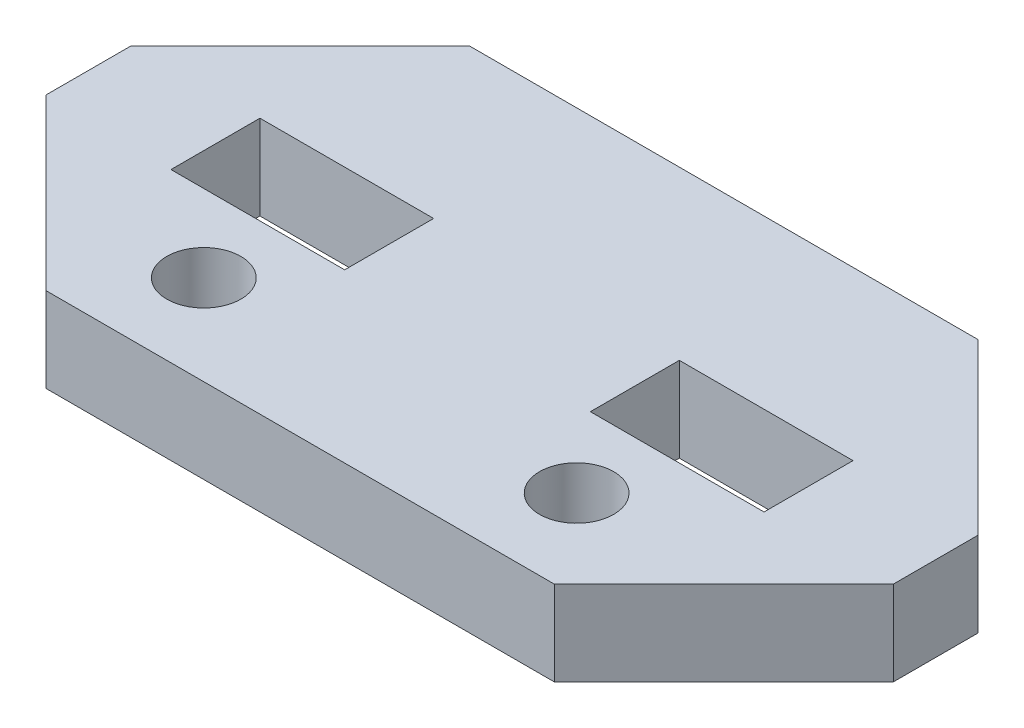
ISO-10303-21;
HEADER;
FILE_DESCRIPTION(('STEP AP214'),'2;1');
FILE_NAME('part.step','',(''),(''),'','','');
FILE_SCHEMA(('AUTOMOTIVE_DESIGN { 1 0 10303 214 1 1 1 1 }'));
ENDSEC;
DATA;
#1=APPLICATION_CONTEXT('core data for automotive mechanical design processes');
#2=APPLICATION_PROTOCOL_DEFINITION('international standard','automotive_design',2000,#1);
#3=PRODUCT_CONTEXT('',#1,'mechanical');
#4=PRODUCT('Part','Part','',(#3));
#5=PRODUCT_RELATED_PRODUCT_CATEGORY('part','',(#4));
#6=PRODUCT_DEFINITION_FORMATION('','',#4);
#7=PRODUCT_DEFINITION_CONTEXT('part definition',#1,'design');
#8=PRODUCT_DEFINITION('design','',#6,#7);
#9=PRODUCT_DEFINITION_SHAPE('','',#8);
#10=(LENGTH_UNIT() NAMED_UNIT(*) SI_UNIT(.MILLI.,.METRE.));
#11=(NAMED_UNIT(*) PLANE_ANGLE_UNIT() SI_UNIT($,.RADIAN.));
#12=(NAMED_UNIT(*) SI_UNIT($,.STERADIAN.) SOLID_ANGLE_UNIT());
#13=UNCERTAINTY_MEASURE_WITH_UNIT(LENGTH_MEASURE(1.E-05),#10,'distance_accuracy_value','');
#14=(GEOMETRIC_REPRESENTATION_CONTEXT(3) GLOBAL_UNCERTAINTY_ASSIGNED_CONTEXT((#13)) GLOBAL_UNIT_ASSIGNED_CONTEXT((#10,
#11,#12)) REPRESENTATION_CONTEXT('',''));
#15=CARTESIAN_POINT('',(0.,0.,0.));
#16=DIRECTION('',(0.,0.,1.));
#17=DIRECTION('',(1.,0.,0.));
#18=AXIS2_PLACEMENT_3D('',#15,#16,#17);
#19=CARTESIAN_POINT('',(0.,4.,0.));
#20=DIRECTION('',(0.,-1.,0.));
#21=DIRECTION('',(0.,0.,-1.));
#22=AXIS2_PLACEMENT_3D('',#19,#20,#21);
#23=PLANE('',#22);
#24=CARTESIAN_POINT('',(-8.8,4.,5.75));
#25=DIRECTION('',(0.,1.,0.));
#26=DIRECTION('',(0.,0.,1.));
#27=AXIS2_PLACEMENT_3D('',#24,#25,#26);
#28=CIRCLE('',#27,1.75);
#29=CARTESIAN_POINT('',(-8.8,4.,7.5));
#30=VERTEX_POINT('',#29);
#31=EDGE_CURVE('E374',#30,#30,#28,.T.);
#32=ORIENTED_EDGE('',*,*,#31,.F.);
#33=EDGE_LOOP('',(#32));
#34=FACE_BOUND('',#33,.T.);
#35=CARTESIAN_POINT('',(8.8,4.,5.75));
#36=DIRECTION('',(0.,1.,0.));
#37=DIRECTION('',(0.,0.,1.));
#38=AXIS2_PLACEMENT_3D('',#35,#36,#37);
#39=CIRCLE('',#38,1.75);
#40=CARTESIAN_POINT('',(8.8,4.,7.5));
#41=VERTEX_POINT('',#40);
#42=EDGE_CURVE('E378',#41,#41,#39,.T.);
#43=ORIENTED_EDGE('',*,*,#42,.F.);
#44=EDGE_LOOP('',(#43));
#45=FACE_BOUND('',#44,.T.);
#46=DIRECTION('',(-1.,0.,0.));
#47=VECTOR('',#46,1.);
#48=CARTESIAN_POINT('',(-5.8,4.,-2.1));
#49=LINE('',#48,#47);
#50=CARTESIAN_POINT('',(-5.8,4.,-2.1));
#51=VERTEX_POINT('',#50);
#52=CARTESIAN_POINT('',(-14.,4.,-2.1));
#53=VERTEX_POINT('',#52);
#54=EDGE_CURVE('E181',#51,#53,#49,.T.);
#55=ORIENTED_EDGE('',*,*,#54,.F.);
#56=DIRECTION('',(0.,0.,-1.));
#57=VECTOR('',#56,1.);
#58=CARTESIAN_POINT('',(-5.8,4.,2.1));
#59=LINE('',#58,#57);
#60=CARTESIAN_POINT('',(-5.8,4.,2.1));
#61=VERTEX_POINT('',#60);
#62=EDGE_CURVE('E175',#61,#51,#59,.T.);
#63=ORIENTED_EDGE('',*,*,#62,.F.);
#64=DIRECTION('',(-1.,0.,0.));
#65=VECTOR('',#64,1.);
#66=CARTESIAN_POINT('',(-5.8,4.,2.1));
#67=LINE('',#66,#65);
#68=CARTESIAN_POINT('',(-14.,4.,2.1));
#69=VERTEX_POINT('',#68);
#70=EDGE_CURVE('E186',#61,#69,#67,.T.);
#71=ORIENTED_EDGE('',*,*,#70,.T.);
#72=DIRECTION('',(0.,0.,-1.));
#73=VECTOR('',#72,1.);
#74=CARTESIAN_POINT('',(-14.,4.,2.1));
#75=LINE('',#74,#73);
#76=EDGE_CURVE('E60',#69,#53,#75,.T.);
#77=ORIENTED_EDGE('',*,*,#76,.T.);
#78=EDGE_LOOP('',(#55,#63,#71,#77));
#79=FACE_BOUND('',#78,.T.);
#80=DIRECTION('',(-0.707106781186548,0.,0.707106781186547));
#81=VECTOR('',#80,1.);
#82=CARTESIAN_POINT('',(20.,4.,2.));
#83=LINE('',#82,#81);
#84=CARTESIAN_POINT('',(20.,4.,2.));
#85=VERTEX_POINT('',#84);
#86=CARTESIAN_POINT('',(12.,4.,10.));
#87=VERTEX_POINT('',#86);
#88=EDGE_CURVE('E227',#85,#87,#83,.T.);
#89=ORIENTED_EDGE('',*,*,#88,.F.);
#90=DIRECTION('',(0.,0.,-1.));
#91=VECTOR('',#90,1.);
#92=CARTESIAN_POINT('',(20.,4.,2.));
#93=LINE('',#92,#91);
#94=CARTESIAN_POINT('',(20.,4.,-2.));
#95=VERTEX_POINT('',#94);
#96=EDGE_CURVE('E248',#85,#95,#93,.T.);
#97=ORIENTED_EDGE('',*,*,#96,.T.);
#98=DIRECTION('',(0.707106781186547,0.,0.707106781186548));
#99=VECTOR('',#98,1.);
#100=CARTESIAN_POINT('',(12.,4.,-10.));
#101=LINE('',#100,#99);
#102=CARTESIAN_POINT('',(12.,4.,-10.));
#103=VERTEX_POINT('',#102);
#104=EDGE_CURVE('E245',#103,#95,#101,.T.);
#105=ORIENTED_EDGE('',*,*,#104,.F.);
#106=DIRECTION('',(-1.,0.,0.));
#107=VECTOR('',#106,1.);
#108=CARTESIAN_POINT('',(12.,4.,-10.));
#109=LINE('',#108,#107);
#110=CARTESIAN_POINT('',(-12.,4.,-10.));
#111=VERTEX_POINT('',#110);
#112=EDGE_CURVE('E243',#103,#111,#109,.T.);
#113=ORIENTED_EDGE('',*,*,#112,.T.);
#114=DIRECTION('',(0.707106781186548,0.,-0.707106781186547));
#115=VECTOR('',#114,1.);
#116=CARTESIAN_POINT('',(-20.,4.,-2.));
#117=LINE('',#116,#115);
#118=CARTESIAN_POINT('',(-20.,4.,-2.));
#119=VERTEX_POINT('',#118);
#120=EDGE_CURVE('E240',#119,#111,#117,.T.);
#121=ORIENTED_EDGE('',*,*,#120,.F.);
#122=DIRECTION('',(0.,0.,-1.));
#123=VECTOR('',#122,1.);
#124=CARTESIAN_POINT('',(-20.,4.,2.));
#125=LINE('',#124,#123);
#126=CARTESIAN_POINT('',(-20.,4.,2.));
#127=VERTEX_POINT('',#126);
#128=EDGE_CURVE('E237',#127,#119,#125,.T.);
#129=ORIENTED_EDGE('',*,*,#128,.F.);
#130=DIRECTION('',(-0.707106781186547,0.,-0.707106781186548));
#131=VECTOR('',#130,1.);
#132=CARTESIAN_POINT('',(-12.,4.,10.));
#133=LINE('',#132,#131);
#134=CARTESIAN_POINT('',(-12.,4.,10.));
#135=VERTEX_POINT('',#134);
#136=EDGE_CURVE('E234',#135,#127,#133,.T.);
#137=ORIENTED_EDGE('',*,*,#136,.F.);
#138=DIRECTION('',(-1.,0.,0.));
#139=VECTOR('',#138,1.);
#140=CARTESIAN_POINT('',(12.,4.,10.));
#141=LINE('',#140,#139);
#142=EDGE_CURVE('E230',#87,#135,#141,.T.);
#143=ORIENTED_EDGE('',*,*,#142,.F.);
#144=EDGE_LOOP('',(#89,#97,#105,#113,#121,#129,#137,#143));
#145=FACE_BOUND('',#144,.T.);
#146=DIRECTION('',(1.,0.,0.));
#147=VECTOR('',#146,1.);
#148=CARTESIAN_POINT('',(5.80000000000001,4.,-2.1));
#149=LINE('',#148,#147);
#150=CARTESIAN_POINT('',(5.80000000000001,4.,-2.1));
#151=VERTEX_POINT('',#150);
#152=CARTESIAN_POINT('',(14.,4.,-2.1));
#153=VERTEX_POINT('',#152);
#154=EDGE_CURVE('E68',#151,#153,#149,.T.);
#155=ORIENTED_EDGE('',*,*,#154,.T.);
#156=DIRECTION('',(0.,0.,-1.));
#157=VECTOR('',#156,1.);
#158=CARTESIAN_POINT('',(14.,4.,2.1));
#159=LINE('',#158,#157);
#160=CARTESIAN_POINT('',(14.,4.,2.1));
#161=VERTEX_POINT('',#160);
#162=EDGE_CURVE('E210',#161,#153,#159,.T.);
#163=ORIENTED_EDGE('',*,*,#162,.F.);
#164=DIRECTION('',(1.,0.,0.));
#165=VECTOR('',#164,1.);
#166=CARTESIAN_POINT('',(5.80000000000001,4.,2.1));
#167=LINE('',#166,#165);
#168=CARTESIAN_POINT('',(5.80000000000001,4.,2.1));
#169=VERTEX_POINT('',#168);
#170=EDGE_CURVE('E222',#169,#161,#167,.T.);
#171=ORIENTED_EDGE('',*,*,#170,.F.);
#172=DIRECTION('',(0.,0.,-1.));
#173=VECTOR('',#172,1.);
#174=CARTESIAN_POINT('',(5.80000000000001,4.,2.1));
#175=LINE('',#174,#173);
#176=EDGE_CURVE('E201',#169,#151,#175,.T.);
#177=ORIENTED_EDGE('',*,*,#176,.T.);
#178=EDGE_LOOP('',(#155,#163,#171,#177));
#179=FACE_BOUND('',#178,.T.);
#180=ADVANCED_FACE('F43',(#34,#45,#79,#145,#179),#23,.F.);
#181=CARTESIAN_POINT('',(0.,0.,0.));
#182=DIRECTION('',(0.,-1.,0.));
#183=DIRECTION('',(0.,0.,-1.));
#184=AXIS2_PLACEMENT_3D('',#181,#182,#183);
#185=PLANE('',#184);
#186=CARTESIAN_POINT('',(-8.8,0.,5.75));
#187=DIRECTION('',(0.,-1.,0.));
#188=DIRECTION('',(0.,0.,-1.));
#189=AXIS2_PLACEMENT_3D('',#186,#187,#188);
#190=CIRCLE('',#189,1.75);
#191=CARTESIAN_POINT('',(-8.8,0.,4.));
#192=VERTEX_POINT('',#191);
#193=EDGE_CURVE('E214',#192,#192,#190,.F.);
#194=ORIENTED_EDGE('',*,*,#193,.T.);
#195=EDGE_LOOP('',(#194));
#196=FACE_BOUND('',#195,.T.);
#197=CARTESIAN_POINT('',(8.8,0.,5.75));
#198=DIRECTION('',(0.,-1.,0.));
#199=DIRECTION('',(0.,0.,-1.));
#200=AXIS2_PLACEMENT_3D('',#197,#198,#199);
#201=CIRCLE('',#200,1.75);
#202=CARTESIAN_POINT('',(8.8,0.,4.));
#203=VERTEX_POINT('',#202);
#204=EDGE_CURVE('E381',#203,#203,#201,.F.);
#205=ORIENTED_EDGE('',*,*,#204,.T.);
#206=EDGE_LOOP('',(#205));
#207=FACE_BOUND('',#206,.T.);
#208=DIRECTION('',(0.,0.,-1.));
#209=VECTOR('',#208,1.);
#210=CARTESIAN_POINT('',(-5.8,0.,2.1));
#211=LINE('',#210,#209);
#212=CARTESIAN_POINT('',(-5.8,0.,2.1));
#213=VERTEX_POINT('',#212);
#214=CARTESIAN_POINT('',(-5.8,0.,-2.1));
#215=VERTEX_POINT('',#214);
#216=EDGE_CURVE('E172',#213,#215,#211,.T.);
#217=ORIENTED_EDGE('',*,*,#216,.T.);
#218=DIRECTION('',(-1.,0.,0.));
#219=VECTOR('',#218,1.);
#220=CARTESIAN_POINT('',(-5.8,0.,-2.1));
#221=LINE('',#220,#219);
#222=CARTESIAN_POINT('',(-14.,0.,-2.1));
#223=VERTEX_POINT('',#222);
#224=EDGE_CURVE('E158',#215,#223,#221,.T.);
#225=ORIENTED_EDGE('',*,*,#224,.T.);
#226=DIRECTION('',(0.,0.,-1.));
#227=VECTOR('',#226,1.);
#228=CARTESIAN_POINT('',(-14.,0.,2.1));
#229=LINE('',#228,#227);
#230=CARTESIAN_POINT('',(-14.,0.,2.1));
#231=VERTEX_POINT('',#230);
#232=EDGE_CURVE('E189',#231,#223,#229,.T.);
#233=ORIENTED_EDGE('',*,*,#232,.F.);
#234=DIRECTION('',(-1.,0.,0.));
#235=VECTOR('',#234,1.);
#236=CARTESIAN_POINT('',(-5.8,0.,2.1));
#237=LINE('',#236,#235);
#238=EDGE_CURVE('E180',#213,#231,#237,.T.);
#239=ORIENTED_EDGE('',*,*,#238,.F.);
#240=EDGE_LOOP('',(#217,#225,#233,#239));
#241=FACE_BOUND('',#240,.T.);
#242=DIRECTION('',(-0.707106781186548,0.,0.707106781186547));
#243=VECTOR('',#242,1.);
#244=CARTESIAN_POINT('',(20.,0.,2.));
#245=LINE('',#244,#243);
#246=CARTESIAN_POINT('',(20.,0.,2.));
#247=VERTEX_POINT('',#246);
#248=CARTESIAN_POINT('',(12.,0.,10.));
#249=VERTEX_POINT('',#248);
#250=EDGE_CURVE('E250',#247,#249,#245,.T.);
#251=ORIENTED_EDGE('',*,*,#250,.T.);
#252=DIRECTION('',(-1.,0.,0.));
#253=VECTOR('',#252,1.);
#254=CARTESIAN_POINT('',(12.,0.,10.));
#255=LINE('',#254,#253);
#256=CARTESIAN_POINT('',(-12.,0.,10.));
#257=VERTEX_POINT('',#256);
#258=EDGE_CURVE('E253',#249,#257,#255,.T.);
#259=ORIENTED_EDGE('',*,*,#258,.T.);
#260=DIRECTION('',(-0.707106781186547,0.,-0.707106781186548));
#261=VECTOR('',#260,1.);
#262=CARTESIAN_POINT('',(-12.,0.,10.));
#263=LINE('',#262,#261);
#264=CARTESIAN_POINT('',(-20.,0.,2.));
#265=VERTEX_POINT('',#264);
#266=EDGE_CURVE('E256',#257,#265,#263,.T.);
#267=ORIENTED_EDGE('',*,*,#266,.T.);
#268=DIRECTION('',(0.,0.,-1.));
#269=VECTOR('',#268,1.);
#270=CARTESIAN_POINT('',(-20.,0.,2.));
#271=LINE('',#270,#269);
#272=CARTESIAN_POINT('',(-20.,0.,-2.));
#273=VERTEX_POINT('',#272);
#274=EDGE_CURVE('E259',#265,#273,#271,.T.);
#275=ORIENTED_EDGE('',*,*,#274,.T.);
#276=DIRECTION('',(0.707106781186548,0.,-0.707106781186547));
#277=VECTOR('',#276,1.);
#278=CARTESIAN_POINT('',(-20.,0.,-2.));
#279=LINE('',#278,#277);
#280=CARTESIAN_POINT('',(-12.,0.,-10.));
#281=VERTEX_POINT('',#280);
#282=EDGE_CURVE('E262',#273,#281,#279,.T.);
#283=ORIENTED_EDGE('',*,*,#282,.T.);
#284=DIRECTION('',(-1.,0.,0.));
#285=VECTOR('',#284,1.);
#286=CARTESIAN_POINT('',(12.,0.,-10.));
#287=LINE('',#286,#285);
#288=CARTESIAN_POINT('',(12.,0.,-10.));
#289=VERTEX_POINT('',#288);
#290=EDGE_CURVE('E265',#289,#281,#287,.T.);
#291=ORIENTED_EDGE('',*,*,#290,.F.);
#292=DIRECTION('',(0.707106781186547,0.,0.707106781186548));
#293=VECTOR('',#292,1.);
#294=CARTESIAN_POINT('',(12.,0.,-10.));
#295=LINE('',#294,#293);
#296=CARTESIAN_POINT('',(20.,0.,-2.));
#297=VERTEX_POINT('',#296);
#298=EDGE_CURVE('E268',#289,#297,#295,.T.);
#299=ORIENTED_EDGE('',*,*,#298,.T.);
#300=DIRECTION('',(0.,0.,-1.));
#301=VECTOR('',#300,1.);
#302=CARTESIAN_POINT('',(20.,0.,2.));
#303=LINE('',#302,#301);
#304=EDGE_CURVE('E231',#247,#297,#303,.T.);
#305=ORIENTED_EDGE('',*,*,#304,.F.);
#306=EDGE_LOOP('',(#251,#259,#267,#275,#283,#291,#299,#305));
#307=FACE_BOUND('',#306,.T.);
#308=DIRECTION('',(0.,0.,-1.));
#309=VECTOR('',#308,1.);
#310=CARTESIAN_POINT('',(14.,0.,2.1));
#311=LINE('',#310,#309);
#312=CARTESIAN_POINT('',(14.,0.,2.1));
#313=VERTEX_POINT('',#312);
#314=CARTESIAN_POINT('',(14.,0.,-2.1));
#315=VERTEX_POINT('',#314);
#316=EDGE_CURVE('E206',#313,#315,#311,.T.);
#317=ORIENTED_EDGE('',*,*,#316,.T.);
#318=DIRECTION('',(1.,0.,0.));
#319=VECTOR('',#318,1.);
#320=CARTESIAN_POINT('',(5.80000000000001,0.,-2.1));
#321=LINE('',#320,#319);
#322=CARTESIAN_POINT('',(5.80000000000001,0.,-2.1));
#323=VERTEX_POINT('',#322);
#324=EDGE_CURVE('E211',#323,#315,#321,.T.);
#325=ORIENTED_EDGE('',*,*,#324,.F.);
#326=DIRECTION('',(0.,0.,-1.));
#327=VECTOR('',#326,1.);
#328=CARTESIAN_POINT('',(5.80000000000001,0.,2.1));
#329=LINE('',#328,#327);
#330=CARTESIAN_POINT('',(5.80000000000001,0.,2.1));
#331=VERTEX_POINT('',#330);
#332=EDGE_CURVE('E207',#331,#323,#329,.T.);
#333=ORIENTED_EDGE('',*,*,#332,.F.);
#334=DIRECTION('',(1.,0.,0.));
#335=VECTOR('',#334,1.);
#336=CARTESIAN_POINT('',(5.80000000000001,0.,2.1));
#337=LINE('',#336,#335);
#338=EDGE_CURVE('E203',#331,#313,#337,.T.);
#339=ORIENTED_EDGE('',*,*,#338,.T.);
#340=EDGE_LOOP('',(#317,#325,#333,#339));
#341=FACE_BOUND('',#340,.T.);
#342=ADVANCED_FACE('F178',(#196,#207,#241,#307,#341),#185,.T.);
#343=CARTESIAN_POINT('',(20.,4.,2.));
#344=DIRECTION('',(0.707106781186547,0.,0.707106781186548));
#345=DIRECTION('',(0.707106781186548,0.,-0.707106781186547));
#346=AXIS2_PLACEMENT_3D('',#343,#344,#345);
#347=PLANE('',#346);
#348=ORIENTED_EDGE('',*,*,#250,.F.);
#349=DIRECTION('',(0.,-1.,0.));
#350=VECTOR('',#349,1.);
#351=CARTESIAN_POINT('',(20.,4.,2.));
#352=LINE('',#351,#350);
#353=EDGE_CURVE('E11',#85,#247,#352,.T.);
#354=ORIENTED_EDGE('',*,*,#353,.F.);
#355=ORIENTED_EDGE('',*,*,#88,.T.);
#356=DIRECTION('',(0.,-1.,0.));
#357=VECTOR('',#356,1.);
#358=CARTESIAN_POINT('',(12.,4.,10.));
#359=LINE('',#358,#357);
#360=EDGE_CURVE('E47',#87,#249,#359,.T.);
#361=ORIENTED_EDGE('',*,*,#360,.T.);
#362=EDGE_LOOP('',(#348,#354,#355,#361));
#363=FACE_BOUND('',#362,.T.);
#364=ADVANCED_FACE('F45',(#363),#347,.T.);
#365=CARTESIAN_POINT('',(20.,4.,2.));
#366=DIRECTION('',(-1.,0.,0.));
#367=DIRECTION('',(0.,0.,1.));
#368=AXIS2_PLACEMENT_3D('',#365,#366,#367);
#369=PLANE('',#368);
#370=ORIENTED_EDGE('',*,*,#304,.T.);
#371=DIRECTION('',(0.,-1.,0.));
#372=VECTOR('',#371,1.);
#373=CARTESIAN_POINT('',(20.,4.,-2.));
#374=LINE('',#373,#372);
#375=EDGE_CURVE('E52',#95,#297,#374,.T.);
#376=ORIENTED_EDGE('',*,*,#375,.F.);
#377=ORIENTED_EDGE('',*,*,#96,.F.);
#378=ORIENTED_EDGE('',*,*,#353,.T.);
#379=EDGE_LOOP('',(#370,#376,#377,#378));
#380=FACE_BOUND('',#379,.T.);
#381=ADVANCED_FACE('F296',(#380),#369,.F.);
#382=CARTESIAN_POINT('',(12.,4.,-10.));
#383=DIRECTION('',(0.707106781186548,0.,-0.707106781186547));
#384=DIRECTION('',(-0.707106781186547,0.,-0.707106781186548));
#385=AXIS2_PLACEMENT_3D('',#382,#383,#384);
#386=PLANE('',#385);
#387=ORIENTED_EDGE('',*,*,#298,.F.);
#388=DIRECTION('',(0.,-1.,0.));
#389=VECTOR('',#388,1.);
#390=CARTESIAN_POINT('',(12.,4.,-10.));
#391=LINE('',#390,#389);
#392=EDGE_CURVE('E274',#103,#289,#391,.T.);
#393=ORIENTED_EDGE('',*,*,#392,.F.);
#394=ORIENTED_EDGE('',*,*,#104,.T.);
#395=ORIENTED_EDGE('',*,*,#375,.T.);
#396=EDGE_LOOP('',(#387,#393,#394,#395));
#397=FACE_BOUND('',#396,.T.);
#398=ADVANCED_FACE('F317',(#397),#386,.T.);
#399=CARTESIAN_POINT('',(12.,4.,-10.));
#400=DIRECTION('',(0.,0.,1.));
#401=DIRECTION('',(1.,0.,0.));
#402=AXIS2_PLACEMENT_3D('',#399,#400,#401);
#403=PLANE('',#402);
#404=ORIENTED_EDGE('',*,*,#290,.T.);
#405=DIRECTION('',(0.,-1.,0.));
#406=VECTOR('',#405,1.);
#407=CARTESIAN_POINT('',(-12.,4.,-10.));
#408=LINE('',#407,#406);
#409=EDGE_CURVE('E276',#111,#281,#408,.T.);
#410=ORIENTED_EDGE('',*,*,#409,.F.);
#411=ORIENTED_EDGE('',*,*,#112,.F.);
#412=ORIENTED_EDGE('',*,*,#392,.T.);
#413=EDGE_LOOP('',(#404,#410,#411,#412));
#414=FACE_BOUND('',#413,.T.);
#415=ADVANCED_FACE('F315',(#414),#403,.F.);
#416=CARTESIAN_POINT('',(-20.,4.,-2.));
#417=DIRECTION('',(-0.707106781186547,0.,-0.707106781186548));
#418=DIRECTION('',(-0.707106781186548,0.,0.707106781186547));
#419=AXIS2_PLACEMENT_3D('',#416,#417,#418);
#420=PLANE('',#419);
#421=ORIENTED_EDGE('',*,*,#282,.F.);
#422=DIRECTION('',(0.,-1.,0.));
#423=VECTOR('',#422,1.);
#424=CARTESIAN_POINT('',(-20.,4.,-2.));
#425=LINE('',#424,#423);
#426=EDGE_CURVE('E278',#119,#273,#425,.T.);
#427=ORIENTED_EDGE('',*,*,#426,.F.);
#428=ORIENTED_EDGE('',*,*,#120,.T.);
#429=ORIENTED_EDGE('',*,*,#409,.T.);
#430=EDGE_LOOP('',(#421,#427,#428,#429));
#431=FACE_BOUND('',#430,.T.);
#432=ADVANCED_FACE('F311',(#431),#420,.T.);
#433=CARTESIAN_POINT('',(-20.,4.,2.));
#434=DIRECTION('',(-1.,0.,0.));
#435=DIRECTION('',(0.,0.,1.));
#436=AXIS2_PLACEMENT_3D('',#433,#434,#435);
#437=PLANE('',#436);
#438=ORIENTED_EDGE('',*,*,#274,.F.);
#439=DIRECTION('',(0.,-1.,0.));
#440=VECTOR('',#439,1.);
#441=CARTESIAN_POINT('',(-20.,4.,2.));
#442=LINE('',#441,#440);
#443=EDGE_CURVE('E280',#127,#265,#442,.T.);
#444=ORIENTED_EDGE('',*,*,#443,.F.);
#445=ORIENTED_EDGE('',*,*,#128,.T.);
#446=ORIENTED_EDGE('',*,*,#426,.T.);
#447=EDGE_LOOP('',(#438,#444,#445,#446));
#448=FACE_BOUND('',#447,.T.);
#449=ADVANCED_FACE('F309',(#448),#437,.T.);
#450=CARTESIAN_POINT('',(-12.,4.,10.));
#451=DIRECTION('',(-0.707106781186548,0.,0.707106781186547));
#452=DIRECTION('',(0.707106781186547,0.,0.707106781186548));
#453=AXIS2_PLACEMENT_3D('',#450,#451,#452);
#454=PLANE('',#453);
#455=ORIENTED_EDGE('',*,*,#266,.F.);
#456=DIRECTION('',(0.,-1.,0.));
#457=VECTOR('',#456,1.);
#458=CARTESIAN_POINT('',(-12.,4.,10.));
#459=LINE('',#458,#457);
#460=EDGE_CURVE('E281',#135,#257,#459,.T.);
#461=ORIENTED_EDGE('',*,*,#460,.F.);
#462=ORIENTED_EDGE('',*,*,#136,.T.);
#463=ORIENTED_EDGE('',*,*,#443,.T.);
#464=EDGE_LOOP('',(#455,#461,#462,#463));
#465=FACE_BOUND('',#464,.T.);
#466=ADVANCED_FACE('F305',(#465),#454,.T.);
#467=CARTESIAN_POINT('',(12.,4.,10.));
#468=DIRECTION('',(0.,0.,1.));
#469=DIRECTION('',(1.,0.,0.));
#470=AXIS2_PLACEMENT_3D('',#467,#468,#469);
#471=PLANE('',#470);
#472=ORIENTED_EDGE('',*,*,#258,.F.);
#473=ORIENTED_EDGE('',*,*,#360,.F.);
#474=ORIENTED_EDGE('',*,*,#142,.T.);
#475=ORIENTED_EDGE('',*,*,#460,.T.);
#476=EDGE_LOOP('',(#472,#473,#474,#475));
#477=FACE_BOUND('',#476,.T.);
#478=ADVANCED_FACE('F289',(#477),#471,.T.);
#479=CARTESIAN_POINT('',(5.80000000000001,-9.21303424502482,-2.1));
#480=DIRECTION('',(0.,0.,1.));
#481=DIRECTION('',(1.,0.,0.));
#482=AXIS2_PLACEMENT_3D('',#479,#480,#481);
#483=PLANE('',#482);
#484=ORIENTED_EDGE('',*,*,#324,.T.);
#485=DIRECTION('',(0.,1.,0.));
#486=VECTOR('',#485,1.);
#487=CARTESIAN_POINT('',(14.,-9.21303424502482,-2.1));
#488=LINE('',#487,#486);
#489=EDGE_CURVE('E204',#315,#153,#488,.T.);
#490=ORIENTED_EDGE('',*,*,#489,.T.);
#491=ORIENTED_EDGE('',*,*,#154,.F.);
#492=DIRECTION('',(0.,1.,0.));
#493=VECTOR('',#492,1.);
#494=CARTESIAN_POINT('',(5.80000000000001,-9.21303424502482,-2.1));
#495=LINE('',#494,#493);
#496=EDGE_CURVE('E190',#323,#151,#495,.T.);
#497=ORIENTED_EDGE('',*,*,#496,.F.);
#498=EDGE_LOOP('',(#484,#490,#491,#497));
#499=FACE_BOUND('',#498,.T.);
#500=ADVANCED_FACE('F348',(#499),#483,.T.);
#501=CARTESIAN_POINT('',(14.,-9.21303424502482,2.1));
#502=DIRECTION('',(1.,0.,0.));
#503=DIRECTION('',(0.,0.,-1.));
#504=AXIS2_PLACEMENT_3D('',#501,#502,#503);
#505=PLANE('',#504);
#506=DIRECTION('',(0.,1.,0.));
#507=VECTOR('',#506,1.);
#508=CARTESIAN_POINT('',(14.,-9.21303424502482,2.1));
#509=LINE('',#508,#507);
#510=EDGE_CURVE('E200',#313,#161,#509,.T.);
#511=ORIENTED_EDGE('',*,*,#510,.T.);
#512=ORIENTED_EDGE('',*,*,#162,.T.);
#513=ORIENTED_EDGE('',*,*,#489,.F.);
#514=ORIENTED_EDGE('',*,*,#316,.F.);
#515=EDGE_LOOP('',(#511,#512,#513,#514));
#516=FACE_BOUND('',#515,.T.);
#517=ADVANCED_FACE('F344',(#516),#505,.F.);
#518=CARTESIAN_POINT('',(5.80000000000001,-9.21303424502482,2.1));
#519=DIRECTION('',(0.,0.,1.));
#520=DIRECTION('',(1.,0.,0.));
#521=AXIS2_PLACEMENT_3D('',#518,#519,#520);
#522=PLANE('',#521);
#523=DIRECTION('',(0.,1.,0.));
#524=VECTOR('',#523,1.);
#525=CARTESIAN_POINT('',(5.80000000000001,-9.21303424502482,2.1));
#526=LINE('',#525,#524);
#527=EDGE_CURVE('E198',#331,#169,#526,.T.);
#528=ORIENTED_EDGE('',*,*,#527,.T.);
#529=ORIENTED_EDGE('',*,*,#170,.T.);
#530=ORIENTED_EDGE('',*,*,#510,.F.);
#531=ORIENTED_EDGE('',*,*,#338,.F.);
#532=EDGE_LOOP('',(#528,#529,#530,#531));
#533=FACE_BOUND('',#532,.T.);
#534=ADVANCED_FACE('F340',(#533),#522,.F.);
#535=CARTESIAN_POINT('',(5.80000000000001,-9.21303424502482,2.1));
#536=DIRECTION('',(1.,0.,0.));
#537=DIRECTION('',(0.,0.,-1.));
#538=AXIS2_PLACEMENT_3D('',#535,#536,#537);
#539=PLANE('',#538);
#540=ORIENTED_EDGE('',*,*,#332,.T.);
#541=ORIENTED_EDGE('',*,*,#496,.T.);
#542=ORIENTED_EDGE('',*,*,#176,.F.);
#543=ORIENTED_EDGE('',*,*,#527,.F.);
#544=EDGE_LOOP('',(#540,#541,#542,#543));
#545=FACE_BOUND('',#544,.T.);
#546=ADVANCED_FACE('F337',(#545),#539,.T.);
#547=CARTESIAN_POINT('',(-5.8,-9.21303424502482,2.1));
#548=DIRECTION('',(1.,0.,0.));
#549=DIRECTION('',(0.,0.,-1.));
#550=AXIS2_PLACEMENT_3D('',#547,#548,#549);
#551=PLANE('',#550);
#552=DIRECTION('',(0.,1.,0.));
#553=VECTOR('',#552,1.);
#554=CARTESIAN_POINT('',(-5.8,-9.21303424502482,2.1));
#555=LINE('',#554,#553);
#556=EDGE_CURVE('E195',#213,#61,#555,.T.);
#557=ORIENTED_EDGE('',*,*,#556,.T.);
#558=ORIENTED_EDGE('',*,*,#62,.T.);
#559=DIRECTION('',(0.,1.,0.));
#560=VECTOR('',#559,1.);
#561=CARTESIAN_POINT('',(-5.8,-9.21303424502482,-2.1));
#562=LINE('',#561,#560);
#563=EDGE_CURVE('E162',#215,#51,#562,.T.);
#564=ORIENTED_EDGE('',*,*,#563,.F.);
#565=ORIENTED_EDGE('',*,*,#216,.F.);
#566=EDGE_LOOP('',(#557,#558,#564,#565));
#567=FACE_BOUND('',#566,.T.);
#568=ADVANCED_FACE('F171',(#567),#551,.F.);
#569=CARTESIAN_POINT('',(-5.8,-9.21303424502482,-2.1));
#570=DIRECTION('',(0.,0.,-1.));
#571=DIRECTION('',(-1.,0.,0.));
#572=AXIS2_PLACEMENT_3D('',#569,#570,#571);
#573=PLANE('',#572);
#574=ORIENTED_EDGE('',*,*,#563,.T.);
#575=ORIENTED_EDGE('',*,*,#54,.T.);
#576=DIRECTION('',(0.,1.,0.));
#577=VECTOR('',#576,1.);
#578=CARTESIAN_POINT('',(-14.,-9.21303424502482,-2.1));
#579=LINE('',#578,#577);
#580=EDGE_CURVE('E164',#223,#53,#579,.T.);
#581=ORIENTED_EDGE('',*,*,#580,.F.);
#582=ORIENTED_EDGE('',*,*,#224,.F.);
#583=EDGE_LOOP('',(#574,#575,#581,#582));
#584=FACE_BOUND('',#583,.T.);
#585=ADVANCED_FACE('F160',(#584),#573,.F.);
#586=CARTESIAN_POINT('',(-14.,-9.21303424502482,2.1));
#587=DIRECTION('',(1.,0.,0.));
#588=DIRECTION('',(0.,0.,-1.));
#589=AXIS2_PLACEMENT_3D('',#586,#587,#588);
#590=PLANE('',#589);
#591=ORIENTED_EDGE('',*,*,#232,.T.);
#592=ORIENTED_EDGE('',*,*,#580,.T.);
#593=ORIENTED_EDGE('',*,*,#76,.F.);
#594=DIRECTION('',(0.,1.,0.));
#595=VECTOR('',#594,1.);
#596=CARTESIAN_POINT('',(-14.,-9.21303424502482,2.1));
#597=LINE('',#596,#595);
#598=EDGE_CURVE('E192',#231,#69,#597,.T.);
#599=ORIENTED_EDGE('',*,*,#598,.F.);
#600=EDGE_LOOP('',(#591,#592,#593,#599));
#601=FACE_BOUND('',#600,.T.);
#602=ADVANCED_FACE('F356',(#601),#590,.T.);
#603=CARTESIAN_POINT('',(-5.8,-9.21303424502482,2.1));
#604=DIRECTION('',(0.,0.,-1.));
#605=DIRECTION('',(-1.,0.,0.));
#606=AXIS2_PLACEMENT_3D('',#603,#604,#605);
#607=PLANE('',#606);
#608=ORIENTED_EDGE('',*,*,#238,.T.);
#609=ORIENTED_EDGE('',*,*,#598,.T.);
#610=ORIENTED_EDGE('',*,*,#70,.F.);
#611=ORIENTED_EDGE('',*,*,#556,.F.);
#612=EDGE_LOOP('',(#608,#609,#610,#611));
#613=FACE_BOUND('',#612,.T.);
#614=ADVANCED_FACE('F359',(#613),#607,.T.);
#615=CARTESIAN_POINT('',(8.8,-4.94974746830583,5.75));
#616=DIRECTION('',(0.,1.,0.));
#617=DIRECTION('',(0.,0.,1.));
#618=AXIS2_PLACEMENT_3D('',#615,#616,#617);
#619=CYLINDRICAL_SURFACE('',#618,1.75);
#620=ORIENTED_EDGE('',*,*,#42,.T.);
#621=EDGE_LOOP('',(#620));
#622=FACE_BOUND('',#621,.T.);
#623=ORIENTED_EDGE('',*,*,#204,.F.);
#624=EDGE_LOOP('',(#623));
#625=FACE_BOUND('',#624,.T.);
#626=ADVANCED_FACE('F362',(#622,#625),#619,.F.);
#627=CARTESIAN_POINT('',(-8.8,-4.94974746830583,5.75));
#628=DIRECTION('',(0.,1.,0.));
#629=DIRECTION('',(0.,0.,1.));
#630=AXIS2_PLACEMENT_3D('',#627,#628,#629);
#631=CYLINDRICAL_SURFACE('',#630,1.75);
#632=ORIENTED_EDGE('',*,*,#31,.T.);
#633=EDGE_LOOP('',(#632));
#634=FACE_BOUND('',#633,.T.);
#635=ORIENTED_EDGE('',*,*,#193,.F.);
#636=EDGE_LOOP('',(#635));
#637=FACE_BOUND('',#636,.T.);
#638=ADVANCED_FACE('F366',(#634,#637),#631,.F.);
#639=CLOSED_SHELL('',(#180,#342,#364,#381,#398,#415,#432,#449,#466,#478,#500,#517,#534,#546,
#568,#585,#602,#614,#626,#638));
#640=MANIFOLD_SOLID_BREP('B2',#639);
#641=ADVANCED_BREP_SHAPE_REPRESENTATION('',(#18,#640),#14);
#642=SHAPE_DEFINITION_REPRESENTATION(#9,#641);
ENDSEC;
END-ISO-10303-21;
